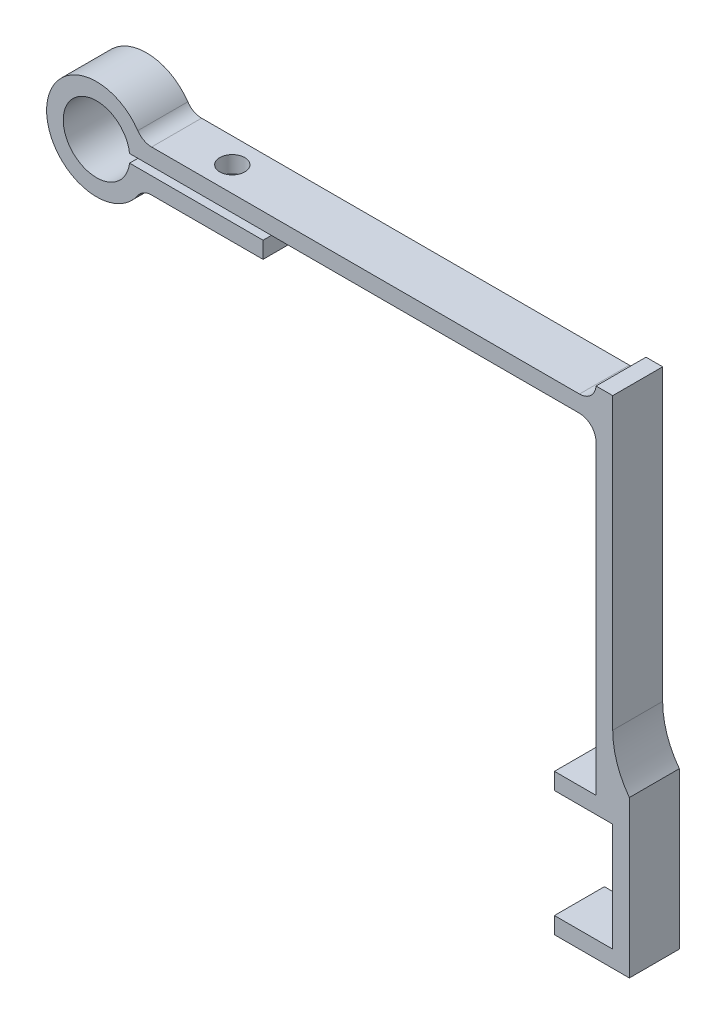
ISO-10303-21;
HEADER;
FILE_DESCRIPTION(('STEP AP214'),'2;1');
FILE_NAME('part.step','',(''),(''),'','','');
FILE_SCHEMA(('AUTOMOTIVE_DESIGN { 1 0 10303 214 1 1 1 1 }'));
ENDSEC;
DATA;
#1=APPLICATION_CONTEXT('core data for automotive mechanical design processes');
#2=APPLICATION_PROTOCOL_DEFINITION('international standard','automotive_design',2000,#1);
#3=PRODUCT_CONTEXT('',#1,'mechanical');
#4=PRODUCT('Part','Part','',(#3));
#5=PRODUCT_RELATED_PRODUCT_CATEGORY('part','',(#4));
#6=PRODUCT_DEFINITION_FORMATION('','',#4);
#7=PRODUCT_DEFINITION_CONTEXT('part definition',#1,'design');
#8=PRODUCT_DEFINITION('design','',#6,#7);
#9=PRODUCT_DEFINITION_SHAPE('','',#8);
#10=(LENGTH_UNIT() NAMED_UNIT(*) SI_UNIT(.MILLI.,.METRE.));
#11=(NAMED_UNIT(*) PLANE_ANGLE_UNIT() SI_UNIT($,.RADIAN.));
#12=(NAMED_UNIT(*) SI_UNIT($,.STERADIAN.) SOLID_ANGLE_UNIT());
#13=UNCERTAINTY_MEASURE_WITH_UNIT(LENGTH_MEASURE(1.E-05),#10,'distance_accuracy_value','');
#14=(GEOMETRIC_REPRESENTATION_CONTEXT(3) GLOBAL_UNCERTAINTY_ASSIGNED_CONTEXT((#13)) GLOBAL_UNIT_ASSIGNED_CONTEXT((#10,
#11,#12)) REPRESENTATION_CONTEXT('',''));
#15=CARTESIAN_POINT('',(0.,0.,0.));
#16=DIRECTION('',(0.,0.,1.));
#17=DIRECTION('',(1.,0.,0.));
#18=AXIS2_PLACEMENT_3D('',#15,#16,#17);
#19=CARTESIAN_POINT('',(62.,0.,0.));
#20=DIRECTION('',(1.,0.,0.));
#21=DIRECTION('',(0.,0.,-1.));
#22=AXIS2_PLACEMENT_3D('',#19,#20,#21);
#23=PLANE('',#22);
#24=DIRECTION('',(0.,0.,-1.));
#25=VECTOR('',#24,1.);
#26=CARTESIAN_POINT('',(62.,-53.25,0.));
#27=LINE('',#26,#25);
#28=CARTESIAN_POINT('',(62.,-53.25,6.));
#29=VERTEX_POINT('',#28);
#30=CARTESIAN_POINT('',(62.,-53.25,0.));
#31=VERTEX_POINT('',#30);
#32=EDGE_CURVE('E195',#29,#31,#27,.T.);
#33=ORIENTED_EDGE('',*,*,#32,.F.);
#34=DIRECTION('',(0.,-1.,0.));
#35=VECTOR('',#34,1.);
#36=CARTESIAN_POINT('',(62.,-36.4757426029915,6.));
#37=LINE('',#36,#35);
#38=CARTESIAN_POINT('',(62.,-40.25,6.));
#39=VERTEX_POINT('',#38);
#40=EDGE_CURVE('E206',#39,#29,#37,.T.);
#41=ORIENTED_EDGE('',*,*,#40,.F.);
#42=DIRECTION('',(0.,0.,-1.));
#43=VECTOR('',#42,1.);
#44=CARTESIAN_POINT('',(62.,-40.25,6.));
#45=LINE('',#44,#43);
#46=CARTESIAN_POINT('',(62.,-40.25,0.));
#47=VERTEX_POINT('',#46);
#48=EDGE_CURVE('E302',#39,#47,#45,.T.);
#49=ORIENTED_EDGE('',*,*,#48,.T.);
#50=DIRECTION('',(0.,1.,0.));
#51=VECTOR('',#50,1.);
#52=CARTESIAN_POINT('',(62.,-36.4757426029915,0.));
#53=LINE('',#52,#51);
#54=EDGE_CURVE('E207',#31,#47,#53,.T.);
#55=ORIENTED_EDGE('',*,*,#54,.F.);
#56=EDGE_LOOP('',(#33,#41,#49,#55));
#57=FACE_BOUND('',#56,.T.);
#58=ADVANCED_FACE('F36',(#57),#23,.F.);
#59=CARTESIAN_POINT('',(60.,0.5,6.));
#60=DIRECTION('',(1.,0.,0.));
#61=DIRECTION('',(0.,1.,0.));
#62=AXIS2_PLACEMENT_3D('',#59,#60,#61);
#63=PLANE('',#62);
#64=DIRECTION('',(0.,0.,-1.));
#65=VECTOR('',#64,1.);
#66=CARTESIAN_POINT('',(60.,-38.25,0.));
#67=LINE('',#66,#65);
#68=CARTESIAN_POINT('',(60.,-38.25,6.));
#69=VERTEX_POINT('',#68);
#70=CARTESIAN_POINT('',(60.,-38.25,0.));
#71=VERTEX_POINT('',#70);
#72=EDGE_CURVE('E51',#69,#71,#67,.T.);
#73=ORIENTED_EDGE('',*,*,#72,.F.);
#74=DIRECTION('',(0.,-1.,0.));
#75=VECTOR('',#74,1.);
#76=CARTESIAN_POINT('',(60.,0.5,6.));
#77=LINE('',#76,#75);
#78=CARTESIAN_POINT('',(60.,-1.5,6.));
#79=VERTEX_POINT('',#78);
#80=EDGE_CURVE('E252',#79,#69,#77,.T.);
#81=ORIENTED_EDGE('',*,*,#80,.F.);
#82=DIRECTION('',(0.,0.,-1.));
#83=VECTOR('',#82,1.);
#84=CARTESIAN_POINT('',(60.,-1.5,0.));
#85=LINE('',#84,#83);
#86=CARTESIAN_POINT('',(60.,-1.5,0.));
#87=VERTEX_POINT('',#86);
#88=EDGE_CURVE('E326',#79,#87,#85,.T.);
#89=ORIENTED_EDGE('',*,*,#88,.T.);
#90=DIRECTION('',(0.,-1.,0.));
#91=VECTOR('',#90,1.);
#92=CARTESIAN_POINT('',(60.,0.5,0.));
#93=LINE('',#92,#91);
#94=EDGE_CURVE('E56',#87,#71,#93,.T.);
#95=ORIENTED_EDGE('',*,*,#94,.T.);
#96=EDGE_LOOP('',(#73,#81,#89,#95));
#97=FACE_BOUND('',#96,.T.);
#98=ADVANCED_FACE('F416',(#97),#63,.F.);
#99=CARTESIAN_POINT('',(62.,-40.25,6.));
#100=DIRECTION('',(-1.,0.,0.));
#101=DIRECTION('',(0.,0.,1.));
#102=AXIS2_PLACEMENT_3D('',#99,#100,#101);
#103=PLANE('',#102);
#104=DIRECTION('',(0.,1.,0.));
#105=VECTOR('',#104,1.);
#106=CARTESIAN_POINT('',(62.,-40.25,6.));
#107=LINE('',#106,#105);
#108=CARTESIAN_POINT('',(62.,-30.4757426029915,6.));
#109=VERTEX_POINT('',#108);
#110=CARTESIAN_POINT('',(62.,4.33119529565432,6.));
#111=VERTEX_POINT('',#110);
#112=EDGE_CURVE('E255',#109,#111,#107,.T.);
#113=ORIENTED_EDGE('',*,*,#112,.F.);
#114=DIRECTION('',(0.,0.,1.));
#115=VECTOR('',#114,1.);
#116=CARTESIAN_POINT('',(62.,-30.4757426029915,6.));
#117=LINE('',#116,#115);
#118=CARTESIAN_POINT('',(62.,-30.4757426029915,0.));
#119=VERTEX_POINT('',#118);
#120=EDGE_CURVE('E346',#109,#119,#117,.F.);
#121=ORIENTED_EDGE('',*,*,#120,.T.);
#122=DIRECTION('',(0.,1.,0.));
#123=VECTOR('',#122,1.);
#124=CARTESIAN_POINT('',(62.,-40.25,0.));
#125=LINE('',#124,#123);
#126=CARTESIAN_POINT('',(62.,4.33119529565432,0.));
#127=VERTEX_POINT('',#126);
#128=EDGE_CURVE('E282',#119,#127,#125,.T.);
#129=ORIENTED_EDGE('',*,*,#128,.T.);
#130=DIRECTION('',(0.,0.,-1.));
#131=VECTOR('',#130,1.);
#132=CARTESIAN_POINT('',(62.,4.33119529565432,6.));
#133=LINE('',#132,#131);
#134=EDGE_CURVE('E299',#111,#127,#133,.T.);
#135=ORIENTED_EDGE('',*,*,#134,.F.);
#136=EDGE_LOOP('',(#113,#121,#129,#135));
#137=FACE_BOUND('',#136,.T.);
#138=ADVANCED_FACE('F357',(#137),#103,.F.);
#139=CARTESIAN_POINT('',(20.,-2.5,6.));
#140=DIRECTION('',(-1.,0.,0.));
#141=DIRECTION('',(0.,0.,1.));
#142=AXIS2_PLACEMENT_3D('',#139,#140,#141);
#143=PLANE('',#142);
#144=DIRECTION('',(0.,1.,0.));
#145=VECTOR('',#144,1.);
#146=CARTESIAN_POINT('',(20.,-2.5,0.));
#147=LINE('',#146,#145);
#148=CARTESIAN_POINT('',(20.,-2.5,0.));
#149=VERTEX_POINT('',#148);
#150=CARTESIAN_POINT('',(20.,-0.5,0.));
#151=VERTEX_POINT('',#150);
#152=EDGE_CURVE('E241',#149,#151,#147,.T.);
#153=ORIENTED_EDGE('',*,*,#152,.T.);
#154=DIRECTION('',(0.,0.,-1.));
#155=VECTOR('',#154,1.);
#156=CARTESIAN_POINT('',(20.,-0.5,6.));
#157=LINE('',#156,#155);
#158=CARTESIAN_POINT('',(20.,-0.5,6.));
#159=VERTEX_POINT('',#158);
#160=EDGE_CURVE('E310',#159,#151,#157,.T.);
#161=ORIENTED_EDGE('',*,*,#160,.F.);
#162=DIRECTION('',(0.,1.,0.));
#163=VECTOR('',#162,1.);
#164=CARTESIAN_POINT('',(20.,-2.5,6.));
#165=LINE('',#164,#163);
#166=CARTESIAN_POINT('',(20.,-2.5,6.));
#167=VERTEX_POINT('',#166);
#168=EDGE_CURVE('E242',#167,#159,#165,.T.);
#169=ORIENTED_EDGE('',*,*,#168,.F.);
#170=DIRECTION('',(0.,0.,-1.));
#171=VECTOR('',#170,1.);
#172=CARTESIAN_POINT('',(20.,-2.5,6.));
#173=LINE('',#172,#171);
#174=EDGE_CURVE('E267',#167,#149,#173,.T.);
#175=ORIENTED_EDGE('',*,*,#174,.T.);
#176=EDGE_LOOP('',(#153,#161,#169,#175));
#177=FACE_BOUND('',#176,.T.);
#178=ADVANCED_FACE('F435',(#177),#143,.F.);
#179=CARTESIAN_POINT('',(4.9749371855331,-0.5,6.));
#180=DIRECTION('',(0.,-1.,0.));
#181=DIRECTION('',(0.,0.,-1.));
#182=AXIS2_PLACEMENT_3D('',#179,#180,#181);
#183=PLANE('',#182);
#184=CARTESIAN_POINT('',(13.3071891388307,-0.5,3.));
#185=DIRECTION('',(0.,-1.,0.));
#186=DIRECTION('',(0.,0.,-1.));
#187=AXIS2_PLACEMENT_3D('',#184,#185,#186);
#188=CIRCLE('',#187,1.5);
#189=CARTESIAN_POINT('',(13.3071891388307,-0.5,1.5));
#190=VERTEX_POINT('',#189);
#191=EDGE_CURVE('E238',#190,#190,#188,.T.);
#192=ORIENTED_EDGE('',*,*,#191,.T.);
#193=EDGE_LOOP('',(#192));
#194=FACE_BOUND('',#193,.T.);
#195=DIRECTION('',(-1.,0.,0.));
#196=VECTOR('',#195,1.);
#197=CARTESIAN_POINT('',(4.9749371855331,-0.5,0.));
#198=LINE('',#197,#196);
#199=CARTESIAN_POINT('',(3.96862696659689,-0.500000000000001,0.));
#200=VERTEX_POINT('',#199);
#201=EDGE_CURVE('E270',#151,#200,#198,.T.);
#202=ORIENTED_EDGE('',*,*,#201,.T.);
#203=DIRECTION('',(0.,0.,-1.));
#204=VECTOR('',#203,1.);
#205=CARTESIAN_POINT('',(3.96862696659689,-0.500000000000001,6.));
#206=LINE('',#205,#204);
#207=CARTESIAN_POINT('',(3.96862696659689,-0.500000000000001,6.));
#208=VERTEX_POINT('',#207);
#209=EDGE_CURVE('E307',#208,#200,#206,.T.);
#210=ORIENTED_EDGE('',*,*,#209,.F.);
#211=DIRECTION('',(-1.,0.,0.));
#212=VECTOR('',#211,1.);
#213=CARTESIAN_POINT('',(4.9749371855331,-0.5,6.));
#214=LINE('',#213,#212);
#215=EDGE_CURVE('E244',#159,#208,#214,.T.);
#216=ORIENTED_EDGE('',*,*,#215,.F.);
#217=ORIENTED_EDGE('',*,*,#160,.T.);
#218=EDGE_LOOP('',(#202,#210,#216,#217));
#219=FACE_BOUND('',#218,.T.);
#220=ADVANCED_FACE('F432',(#194,#219),#183,.F.);
#221=CARTESIAN_POINT('',(0.,0.,6.));
#222=DIRECTION('',(0.,0.,-1.));
#223=DIRECTION('',(-1.,0.,0.));
#224=AXIS2_PLACEMENT_3D('',#221,#222,#223);
#225=CYLINDRICAL_SURFACE('',#224,4.);
#226=CARTESIAN_POINT('',(0.,0.,0.));
#227=DIRECTION('',(0.,0.,-1.));
#228=DIRECTION('',(1.,0.,0.));
#229=AXIS2_PLACEMENT_3D('',#226,#227,#228);
#230=CIRCLE('',#229,4.);
#231=CARTESIAN_POINT('',(3.96862696659689,0.5,0.));
#232=VERTEX_POINT('',#231);
#233=EDGE_CURVE('E272',#200,#232,#230,.T.);
#234=ORIENTED_EDGE('',*,*,#233,.T.);
#235=DIRECTION('',(0.,0.,-1.));
#236=VECTOR('',#235,1.);
#237=CARTESIAN_POINT('',(3.96862696659689,0.5,6.));
#238=LINE('',#237,#236);
#239=CARTESIAN_POINT('',(3.96862696659689,0.5,6.));
#240=VERTEX_POINT('',#239);
#241=EDGE_CURVE('E304',#240,#232,#238,.T.);
#242=ORIENTED_EDGE('',*,*,#241,.F.);
#243=CARTESIAN_POINT('',(0.,0.,6.));
#244=DIRECTION('',(0.,0.,-1.));
#245=DIRECTION('',(1.,0.,0.));
#246=AXIS2_PLACEMENT_3D('',#243,#244,#245);
#247=CIRCLE('',#246,4.);
#248=EDGE_CURVE('E247',#208,#240,#247,.T.);
#249=ORIENTED_EDGE('',*,*,#248,.F.);
#250=ORIENTED_EDGE('',*,*,#209,.T.);
#251=EDGE_LOOP('',(#234,#242,#249,#250));
#252=FACE_BOUND('',#251,.T.);
#253=ADVANCED_FACE('F427',(#252),#225,.F.);
#254=CARTESIAN_POINT('',(9.52711988649814,0.5,6.));
#255=DIRECTION('',(0.,1.,0.));
#256=DIRECTION('',(0.,0.,1.));
#257=AXIS2_PLACEMENT_3D('',#254,#255,#256);
#258=PLANE('',#257);
#259=CARTESIAN_POINT('',(13.3071891388307,0.5,3.));
#260=DIRECTION('',(0.,1.,0.));
#261=DIRECTION('',(0.,0.,1.));
#262=AXIS2_PLACEMENT_3D('',#259,#260,#261);
#263=CIRCLE('',#262,1.5);
#264=CARTESIAN_POINT('',(13.3071891388307,0.5,4.5));
#265=VERTEX_POINT('',#264);
#266=EDGE_CURVE('E235',#265,#265,#263,.T.);
#267=ORIENTED_EDGE('',*,*,#266,.T.);
#268=EDGE_LOOP('',(#267));
#269=FACE_BOUND('',#268,.T.);
#270=DIRECTION('',(1.,0.,0.));
#271=VECTOR('',#270,1.);
#272=CARTESIAN_POINT('',(9.52711988649814,0.5,0.));
#273=LINE('',#272,#271);
#274=CARTESIAN_POINT('',(58.,0.5,0.));
#275=VERTEX_POINT('',#274);
#276=EDGE_CURVE('E275',#232,#275,#273,.T.);
#277=ORIENTED_EDGE('',*,*,#276,.T.);
#278=DIRECTION('',(0.,0.,-1.));
#279=VECTOR('',#278,1.);
#280=CARTESIAN_POINT('',(58.,0.5,6.));
#281=LINE('',#280,#279);
#282=CARTESIAN_POINT('',(58.,0.5,6.));
#283=VERTEX_POINT('',#282);
#284=EDGE_CURVE('E328',#275,#283,#281,.F.);
#285=ORIENTED_EDGE('',*,*,#284,.T.);
#286=DIRECTION('',(1.,0.,0.));
#287=VECTOR('',#286,1.);
#288=CARTESIAN_POINT('',(4.9749371855331,0.5,6.));
#289=LINE('',#288,#287);
#290=EDGE_CURVE('E249',#240,#283,#289,.T.);
#291=ORIENTED_EDGE('',*,*,#290,.F.);
#292=ORIENTED_EDGE('',*,*,#241,.T.);
#293=EDGE_LOOP('',(#277,#285,#291,#292));
#294=FACE_BOUND('',#293,.T.);
#295=ADVANCED_FACE('F422',(#269,#294),#258,.F.);
#296=CARTESIAN_POINT('',(60.,-40.25,6.));
#297=DIRECTION('',(0.,1.,0.));
#298=DIRECTION('',(0.,0.,1.));
#299=AXIS2_PLACEMENT_3D('',#296,#297,#298);
#300=PLANE('',#299);
#301=DIRECTION('',(1.,0.,0.));
#302=VECTOR('',#301,1.);
#303=CARTESIAN_POINT('',(60.,-40.25,0.));
#304=LINE('',#303,#302);
#305=CARTESIAN_POINT('',(55.,-40.25,0.));
#306=VERTEX_POINT('',#305);
#307=EDGE_CURVE('E279',#306,#47,#304,.T.);
#308=ORIENTED_EDGE('',*,*,#307,.T.);
#309=ORIENTED_EDGE('',*,*,#48,.F.);
#310=DIRECTION('',(1.,0.,0.));
#311=VECTOR('',#310,1.);
#312=CARTESIAN_POINT('',(60.,-40.25,6.));
#313=LINE('',#312,#311);
#314=CARTESIAN_POINT('',(55.,-40.25,6.));
#315=VERTEX_POINT('',#314);
#316=EDGE_CURVE('E212',#315,#39,#313,.T.);
#317=ORIENTED_EDGE('',*,*,#316,.F.);
#318=DIRECTION('',(0.,0.,1.));
#319=VECTOR('',#318,1.);
#320=CARTESIAN_POINT('',(55.,-40.25,0.));
#321=LINE('',#320,#319);
#322=EDGE_CURVE('E384',#306,#315,#321,.T.);
#323=ORIENTED_EDGE('',*,*,#322,.F.);
#324=EDGE_LOOP('',(#308,#309,#317,#323));
#325=FACE_BOUND('',#324,.T.);
#326=ADVANCED_FACE('F406',(#325),#300,.F.);
#327=CARTESIAN_POINT('',(62.,4.33119529565432,6.));
#328=DIRECTION('',(0.,-1.,0.));
#329=DIRECTION('',(0.,0.,-1.));
#330=AXIS2_PLACEMENT_3D('',#327,#328,#329);
#331=PLANE('',#330);
#332=DIRECTION('',(-1.,0.,0.));
#333=VECTOR('',#332,1.);
#334=CARTESIAN_POINT('',(62.,4.33119529565432,0.));
#335=LINE('',#334,#333);
#336=CARTESIAN_POINT('',(60.,4.33119529565432,0.));
#337=VERTEX_POINT('',#336);
#338=EDGE_CURVE('E284',#127,#337,#335,.T.);
#339=ORIENTED_EDGE('',*,*,#338,.T.);
#340=DIRECTION('',(0.,0.,-1.));
#341=VECTOR('',#340,1.);
#342=CARTESIAN_POINT('',(60.,4.33119529565432,6.));
#343=LINE('',#342,#341);
#344=CARTESIAN_POINT('',(60.,4.33119529565432,6.));
#345=VERTEX_POINT('',#344);
#346=EDGE_CURVE('E296',#345,#337,#343,.T.);
#347=ORIENTED_EDGE('',*,*,#346,.F.);
#348=DIRECTION('',(-1.,0.,0.));
#349=VECTOR('',#348,1.);
#350=CARTESIAN_POINT('',(62.,4.33119529565432,6.));
#351=LINE('',#350,#349);
#352=EDGE_CURVE('E257',#111,#345,#351,.T.);
#353=ORIENTED_EDGE('',*,*,#352,.F.);
#354=ORIENTED_EDGE('',*,*,#134,.T.);
#355=EDGE_LOOP('',(#339,#347,#353,#354));
#356=FACE_BOUND('',#355,.T.);
#357=ADVANCED_FACE('F464',(#356),#331,.F.);
#358=CARTESIAN_POINT('',(60.,2.5,6.));
#359=DIRECTION('',(0.,-1.,0.));
#360=DIRECTION('',(1.,0.,0.));
#361=AXIS2_PLACEMENT_3D('',#358,#359,#360);
#362=PLANE('',#361);
#363=CARTESIAN_POINT('',(13.3071891388307,2.5,3.));
#364=DIRECTION('',(0.,-1.,0.));
#365=DIRECTION('',(1.,0.,0.));
#366=AXIS2_PLACEMENT_3D('',#363,#364,#365);
#367=CIRCLE('',#366,1.5);
#368=CARTESIAN_POINT('',(14.8071891388307,2.5,3.));
#369=VERTEX_POINT('',#368);
#370=EDGE_CURVE('E232',#369,#369,#367,.T.);
#371=ORIENTED_EDGE('',*,*,#370,.T.);
#372=EDGE_LOOP('',(#371));
#373=FACE_BOUND('',#372,.T.);
#374=DIRECTION('',(-1.,0.,0.));
#375=VECTOR('',#374,1.);
#376=CARTESIAN_POINT('',(60.,2.5,0.));
#377=LINE('',#376,#375);
#378=CARTESIAN_POINT('',(58.0071364894226,2.5,0.));
#379=VERTEX_POINT('',#378);
#380=CARTESIAN_POINT('',(6.61437827766148,2.49999999999999,0.));
#381=VERTEX_POINT('',#380);
#382=EDGE_CURVE('E287',#379,#381,#377,.T.);
#383=ORIENTED_EDGE('',*,*,#382,.T.);
#384=DIRECTION('',(0.,0.,1.));
#385=VECTOR('',#384,1.);
#386=CARTESIAN_POINT('',(6.61437827766148,2.49999999999999,6.));
#387=LINE('',#386,#385);
#388=CARTESIAN_POINT('',(6.61437827766148,2.49999999999999,6.));
#389=VERTEX_POINT('',#388);
#390=EDGE_CURVE('E321',#381,#389,#387,.T.);
#391=ORIENTED_EDGE('',*,*,#390,.T.);
#392=DIRECTION('',(-1.,0.,0.));
#393=VECTOR('',#392,1.);
#394=CARTESIAN_POINT('',(60.,2.5,6.));
#395=LINE('',#394,#393);
#396=CARTESIAN_POINT('',(58.0071364894226,2.5,6.));
#397=VERTEX_POINT('',#396);
#398=EDGE_CURVE('E259',#397,#389,#395,.T.);
#399=ORIENTED_EDGE('',*,*,#398,.F.);
#400=DIRECTION('',(0.,0.,-1.));
#401=VECTOR('',#400,1.);
#402=CARTESIAN_POINT('',(58.0071364894226,2.5,6.));
#403=LINE('',#402,#401);
#404=EDGE_CURVE('E318',#397,#379,#403,.T.);
#405=ORIENTED_EDGE('',*,*,#404,.T.);
#406=EDGE_LOOP('',(#383,#391,#399,#405));
#407=FACE_BOUND('',#406,.T.);
#408=ADVANCED_FACE('F456',(#373,#407),#362,.F.);
#409=CARTESIAN_POINT('',(0.,0.,6.));
#410=DIRECTION('',(0.,0.,-1.));
#411=DIRECTION('',(-1.,0.,0.));
#412=AXIS2_PLACEMENT_3D('',#409,#410,#411);
#413=CYLINDRICAL_SURFACE('',#412,6.);
#414=CARTESIAN_POINT('',(0.,0.,6.));
#415=DIRECTION('',(0.,0.,1.));
#416=DIRECTION('',(1.,0.,0.));
#417=AXIS2_PLACEMENT_3D('',#414,#415,#416);
#418=CIRCLE('',#417,6.);
#419=CARTESIAN_POINT('',(4.96078370824611,3.375,6.));
#420=VERTEX_POINT('',#419);
#421=CARTESIAN_POINT('',(4.96078370824611,-3.375,6.));
#422=VERTEX_POINT('',#421);
#423=EDGE_CURVE('E262',#420,#422,#418,.T.);
#424=ORIENTED_EDGE('',*,*,#423,.F.);
#425=DIRECTION('',(0.,0.,-1.));
#426=VECTOR('',#425,1.);
#427=CARTESIAN_POINT('',(4.96078370824611,3.375,6.));
#428=LINE('',#427,#426);
#429=CARTESIAN_POINT('',(4.96078370824611,3.375,0.));
#430=VERTEX_POINT('',#429);
#431=EDGE_CURVE('E315',#420,#430,#428,.T.);
#432=ORIENTED_EDGE('',*,*,#431,.T.);
#433=CARTESIAN_POINT('',(0.,0.,0.));
#434=DIRECTION('',(0.,0.,1.));
#435=DIRECTION('',(1.,0.,0.));
#436=AXIS2_PLACEMENT_3D('',#433,#434,#435);
#437=CIRCLE('',#436,6.);
#438=CARTESIAN_POINT('',(4.96078370824611,-3.375,0.));
#439=VERTEX_POINT('',#438);
#440=EDGE_CURVE('E290',#430,#439,#437,.T.);
#441=ORIENTED_EDGE('',*,*,#440,.T.);
#442=DIRECTION('',(0.,0.,-1.));
#443=VECTOR('',#442,1.);
#444=CARTESIAN_POINT('',(4.96078370824611,-3.375,6.));
#445=LINE('',#444,#443);
#446=EDGE_CURVE('E313',#439,#422,#445,.F.);
#447=ORIENTED_EDGE('',*,*,#446,.T.);
#448=EDGE_LOOP('',(#424,#432,#441,#447));
#449=FACE_BOUND('',#448,.T.);
#450=ADVANCED_FACE('F446',(#449),#413,.T.);
#451=CARTESIAN_POINT('',(20.,-2.5,6.));
#452=DIRECTION('',(0.,1.,0.));
#453=DIRECTION('',(-1.,0.,0.));
#454=AXIS2_PLACEMENT_3D('',#451,#452,#453);
#455=PLANE('',#454);
#456=CARTESIAN_POINT('',(13.3071891388307,-2.5,3.));
#457=DIRECTION('',(0.,-1.,0.));
#458=DIRECTION('',(1.,0.,0.));
#459=AXIS2_PLACEMENT_3D('',#456,#457,#458);
#460=CIRCLE('',#459,1.5);
#461=CARTESIAN_POINT('',(14.8071891388307,-2.5,3.));
#462=VERTEX_POINT('',#461);
#463=EDGE_CURVE('E229',#462,#462,#460,.T.);
#464=ORIENTED_EDGE('',*,*,#463,.F.);
#465=EDGE_LOOP('',(#464));
#466=FACE_BOUND('',#465,.T.);
#467=DIRECTION('',(1.,0.,0.));
#468=VECTOR('',#467,1.);
#469=CARTESIAN_POINT('',(20.,-2.5,6.));
#470=LINE('',#469,#468);
#471=CARTESIAN_POINT('',(6.61437827766148,-2.5,6.));
#472=VERTEX_POINT('',#471);
#473=EDGE_CURVE('E265',#472,#167,#470,.T.);
#474=ORIENTED_EDGE('',*,*,#473,.F.);
#475=DIRECTION('',(0.,0.,1.));
#476=VECTOR('',#475,1.);
#477=CARTESIAN_POINT('',(6.61437827766148,-2.5,0.));
#478=LINE('',#477,#476);
#479=CARTESIAN_POINT('',(6.61437827766148,-2.5,0.));
#480=VERTEX_POINT('',#479);
#481=EDGE_CURVE('E323',#472,#480,#478,.F.);
#482=ORIENTED_EDGE('',*,*,#481,.T.);
#483=DIRECTION('',(1.,0.,0.));
#484=VECTOR('',#483,1.);
#485=CARTESIAN_POINT('',(20.,-2.5,0.));
#486=LINE('',#485,#484);
#487=EDGE_CURVE('E245',#480,#149,#486,.T.);
#488=ORIENTED_EDGE('',*,*,#487,.T.);
#489=ORIENTED_EDGE('',*,*,#174,.F.);
#490=EDGE_LOOP('',(#474,#482,#488,#489));
#491=FACE_BOUND('',#490,.T.);
#492=ADVANCED_FACE('F439',(#466,#491),#455,.F.);
#493=CARTESIAN_POINT('',(0.,0.,6.));
#494=DIRECTION('',(0.,0.,1.));
#495=DIRECTION('',(1.,0.,0.));
#496=AXIS2_PLACEMENT_3D('',#493,#494,#495);
#497=PLANE('',#496);
#498=ORIENTED_EDGE('',*,*,#168,.T.);
#499=ORIENTED_EDGE('',*,*,#215,.T.);
#500=ORIENTED_EDGE('',*,*,#248,.T.);
#501=ORIENTED_EDGE('',*,*,#290,.T.);
#502=CARTESIAN_POINT('',(58.,-1.5,6.));
#503=DIRECTION('',(0.,0.,1.));
#504=DIRECTION('',(1.,0.,0.));
#505=AXIS2_PLACEMENT_3D('',#502,#503,#504);
#506=CIRCLE('',#505,2.);
#507=EDGE_CURVE('E344',#283,#79,#506,.F.);
#508=ORIENTED_EDGE('',*,*,#507,.T.);
#509=ORIENTED_EDGE('',*,*,#80,.T.);
#510=DIRECTION('',(1.,0.,0.));
#511=VECTOR('',#510,1.);
#512=CARTESIAN_POINT('',(55.,-38.25,6.));
#513=LINE('',#512,#511);
#514=CARTESIAN_POINT('',(55.,-38.25,6.));
#515=VERTEX_POINT('',#514);
#516=EDGE_CURVE('E214',#515,#69,#513,.T.);
#517=ORIENTED_EDGE('',*,*,#516,.F.);
#518=DIRECTION('',(0.,1.,0.));
#519=VECTOR('',#518,1.);
#520=CARTESIAN_POINT('',(55.,-40.25,6.));
#521=LINE('',#520,#519);
#522=EDGE_CURVE('E382',#315,#515,#521,.T.);
#523=ORIENTED_EDGE('',*,*,#522,.F.);
#524=ORIENTED_EDGE('',*,*,#316,.T.);
#525=ORIENTED_EDGE('',*,*,#40,.T.);
#526=DIRECTION('',(1.,0.,0.));
#527=VECTOR('',#526,1.);
#528=CARTESIAN_POINT('',(48.6754446796633,-53.25,6.));
#529=LINE('',#528,#527);
#530=CARTESIAN_POINT('',(55.,-53.25,6.));
#531=VERTEX_POINT('',#530);
#532=EDGE_CURVE('E191',#531,#29,#529,.T.);
#533=ORIENTED_EDGE('',*,*,#532,.F.);
#534=DIRECTION('',(0.,-1.,0.));
#535=VECTOR('',#534,1.);
#536=CARTESIAN_POINT('',(55.,-55.25,6.));
#537=LINE('',#536,#535);
#538=CARTESIAN_POINT('',(55.,-55.25,6.));
#539=VERTEX_POINT('',#538);
#540=EDGE_CURVE('E389',#531,#539,#537,.T.);
#541=ORIENTED_EDGE('',*,*,#540,.T.);
#542=DIRECTION('',(-1.,0.,0.));
#543=VECTOR('',#542,1.);
#544=CARTESIAN_POINT('',(64.,-55.25,6.));
#545=LINE('',#544,#543);
#546=CARTESIAN_POINT('',(64.,-55.25,6.));
#547=VERTEX_POINT('',#546);
#548=EDGE_CURVE('E227',#547,#539,#545,.T.);
#549=ORIENTED_EDGE('',*,*,#548,.F.);
#550=DIRECTION('',(0.,-1.,0.));
#551=VECTOR('',#550,1.);
#552=CARTESIAN_POINT('',(64.,-36.4757426029915,6.));
#553=LINE('',#552,#551);
#554=CARTESIAN_POINT('',(64.,-36.4757426029915,6.));
#555=VERTEX_POINT('',#554);
#556=EDGE_CURVE('E216',#555,#547,#553,.T.);
#557=ORIENTED_EDGE('',*,*,#556,.F.);
#558=CARTESIAN_POINT('',(72.,-30.4757426029915,6.));
#559=DIRECTION('',(0.,0.,1.));
#560=DIRECTION('',(1.,0.,0.));
#561=AXIS2_PLACEMENT_3D('',#558,#559,#560);
#562=CIRCLE('',#561,10.);
#563=EDGE_CURVE('E44',#555,#109,#562,.F.);
#564=ORIENTED_EDGE('',*,*,#563,.T.);
#565=ORIENTED_EDGE('',*,*,#112,.T.);
#566=ORIENTED_EDGE('',*,*,#352,.T.);
#567=CARTESIAN_POINT('',(58.0071364894226,4.5,6.));
#568=DIRECTION('',(0.,0.,1.));
#569=DIRECTION('',(1.,0.,0.));
#570=AXIS2_PLACEMENT_3D('',#567,#568,#569);
#571=CIRCLE('',#570,2.);
#572=EDGE_CURVE('E340',#345,#397,#571,.F.);
#573=ORIENTED_EDGE('',*,*,#572,.T.);
#574=ORIENTED_EDGE('',*,*,#398,.T.);
#575=CARTESIAN_POINT('',(6.61437827766148,4.49999999999999,6.));
#576=DIRECTION('',(0.,0.,1.));
#577=DIRECTION('',(1.,0.,0.));
#578=AXIS2_PLACEMENT_3D('',#575,#576,#577);
#579=CIRCLE('',#578,2.);
#580=EDGE_CURVE('E332',#389,#420,#579,.F.);
#581=ORIENTED_EDGE('',*,*,#580,.T.);
#582=ORIENTED_EDGE('',*,*,#423,.T.);
#583=CARTESIAN_POINT('',(6.61437827766148,-4.5,6.));
#584=DIRECTION('',(0.,0.,1.));
#585=DIRECTION('',(1.,0.,0.));
#586=AXIS2_PLACEMENT_3D('',#583,#584,#585);
#587=CIRCLE('',#586,2.);
#588=EDGE_CURVE('E336',#422,#472,#587,.F.);
#589=ORIENTED_EDGE('',*,*,#588,.T.);
#590=ORIENTED_EDGE('',*,*,#473,.T.);
#591=EDGE_LOOP('',(#498,#499,#500,#501,#508,#509,#517,#523,#524,#525,#533,#541,#549,#557,#564,
#565,#566,#573,#574,#581,#582,#589,#590));
#592=FACE_BOUND('',#591,.T.);
#593=ADVANCED_FACE('F210',(#592),#497,.T.);
#594=CARTESIAN_POINT('',(0.,0.,0.));
#595=DIRECTION('',(0.,0.,1.));
#596=DIRECTION('',(1.,0.,0.));
#597=AXIS2_PLACEMENT_3D('',#594,#595,#596);
#598=PLANE('',#597);
#599=ORIENTED_EDGE('',*,*,#152,.F.);
#600=ORIENTED_EDGE('',*,*,#487,.F.);
#601=CARTESIAN_POINT('',(6.61437827766148,-4.5,0.));
#602=DIRECTION('',(0.,0.,1.));
#603=DIRECTION('',(1.,0.,0.));
#604=AXIS2_PLACEMENT_3D('',#601,#602,#603);
#605=CIRCLE('',#604,2.);
#606=EDGE_CURVE('E334',#480,#439,#605,.T.);
#607=ORIENTED_EDGE('',*,*,#606,.T.);
#608=ORIENTED_EDGE('',*,*,#440,.F.);
#609=CARTESIAN_POINT('',(6.61437827766148,4.49999999999999,0.));
#610=DIRECTION('',(0.,0.,1.));
#611=DIRECTION('',(1.,0.,0.));
#612=AXIS2_PLACEMENT_3D('',#609,#610,#611);
#613=CIRCLE('',#612,2.);
#614=EDGE_CURVE('E330',#430,#381,#613,.T.);
#615=ORIENTED_EDGE('',*,*,#614,.T.);
#616=ORIENTED_EDGE('',*,*,#382,.F.);
#617=CARTESIAN_POINT('',(58.0071364894226,4.5,0.));
#618=DIRECTION('',(0.,0.,1.));
#619=DIRECTION('',(1.,0.,0.));
#620=AXIS2_PLACEMENT_3D('',#617,#618,#619);
#621=CIRCLE('',#620,2.);
#622=EDGE_CURVE('E338',#379,#337,#621,.T.);
#623=ORIENTED_EDGE('',*,*,#622,.T.);
#624=ORIENTED_EDGE('',*,*,#338,.F.);
#625=ORIENTED_EDGE('',*,*,#128,.F.);
#626=CARTESIAN_POINT('',(72.,-30.4757426029915,0.));
#627=DIRECTION('',(0.,0.,1.));
#628=DIRECTION('',(1.,0.,0.));
#629=AXIS2_PLACEMENT_3D('',#626,#627,#628);
#630=CIRCLE('',#629,10.);
#631=CARTESIAN_POINT('',(64.,-36.4757426029915,0.));
#632=VERTEX_POINT('',#631);
#633=EDGE_CURVE('E11',#119,#632,#630,.T.);
#634=ORIENTED_EDGE('',*,*,#633,.T.);
#635=DIRECTION('',(0.,1.,0.));
#636=VECTOR('',#635,1.);
#637=CARTESIAN_POINT('',(64.,-36.4757426029915,0.));
#638=LINE('',#637,#636);
#639=CARTESIAN_POINT('',(64.,-55.25,0.));
#640=VERTEX_POINT('',#639);
#641=EDGE_CURVE('E366',#640,#632,#638,.T.);
#642=ORIENTED_EDGE('',*,*,#641,.F.);
#643=DIRECTION('',(-1.,0.,0.));
#644=VECTOR('',#643,1.);
#645=CARTESIAN_POINT('',(64.,-55.25,0.));
#646=LINE('',#645,#644);
#647=CARTESIAN_POINT('',(55.,-55.25,0.));
#648=VERTEX_POINT('',#647);
#649=EDGE_CURVE('E225',#640,#648,#646,.T.);
#650=ORIENTED_EDGE('',*,*,#649,.T.);
#651=DIRECTION('',(0.,1.,0.));
#652=VECTOR('',#651,1.);
#653=CARTESIAN_POINT('',(55.,-55.25,0.));
#654=LINE('',#653,#652);
#655=CARTESIAN_POINT('',(55.,-53.25,0.));
#656=VERTEX_POINT('',#655);
#657=EDGE_CURVE('E380',#648,#656,#654,.T.);
#658=ORIENTED_EDGE('',*,*,#657,.T.);
#659=DIRECTION('',(1.,0.,0.));
#660=VECTOR('',#659,1.);
#661=CARTESIAN_POINT('',(48.6754446796633,-53.25,0.));
#662=LINE('',#661,#660);
#663=EDGE_CURVE('E201',#656,#31,#662,.T.);
#664=ORIENTED_EDGE('',*,*,#663,.T.);
#665=ORIENTED_EDGE('',*,*,#54,.T.);
#666=ORIENTED_EDGE('',*,*,#307,.F.);
#667=DIRECTION('',(0.,-1.,0.));
#668=VECTOR('',#667,1.);
#669=CARTESIAN_POINT('',(55.,-40.25,0.));
#670=LINE('',#669,#668);
#671=CARTESIAN_POINT('',(55.,-38.25,0.));
#672=VERTEX_POINT('',#671);
#673=EDGE_CURVE('E379',#672,#306,#670,.T.);
#674=ORIENTED_EDGE('',*,*,#673,.F.);
#675=DIRECTION('',(1.,0.,0.));
#676=VECTOR('',#675,1.);
#677=CARTESIAN_POINT('',(55.,-38.25,0.));
#678=LINE('',#677,#676);
#679=EDGE_CURVE('E219',#672,#71,#678,.T.);
#680=ORIENTED_EDGE('',*,*,#679,.T.);
#681=ORIENTED_EDGE('',*,*,#94,.F.);
#682=CARTESIAN_POINT('',(58.,-1.5,0.));
#683=DIRECTION('',(0.,0.,1.));
#684=DIRECTION('',(1.,0.,0.));
#685=AXIS2_PLACEMENT_3D('',#682,#683,#684);
#686=CIRCLE('',#685,2.);
#687=EDGE_CURVE('E342',#87,#275,#686,.T.);
#688=ORIENTED_EDGE('',*,*,#687,.T.);
#689=ORIENTED_EDGE('',*,*,#276,.F.);
#690=ORIENTED_EDGE('',*,*,#233,.F.);
#691=ORIENTED_EDGE('',*,*,#201,.F.);
#692=EDGE_LOOP('',(#599,#600,#607,#608,#615,#616,#623,#624,#625,#634,#642,#650,#658,#664,#665,
#666,#674,#680,#681,#688,#689,#690,#691));
#693=FACE_BOUND('',#692,.T.);
#694=ADVANCED_FACE('F365',(#693),#598,.F.);
#695=CARTESIAN_POINT('',(6.61437827766148,4.49999999999999,6.));
#696=DIRECTION('',(0.,0.,-1.));
#697=DIRECTION('',(-1.,0.,0.));
#698=AXIS2_PLACEMENT_3D('',#695,#696,#697);
#699=CYLINDRICAL_SURFACE('',#698,2.);
#700=ORIENTED_EDGE('',*,*,#580,.F.);
#701=ORIENTED_EDGE('',*,*,#390,.F.);
#702=ORIENTED_EDGE('',*,*,#614,.F.);
#703=ORIENTED_EDGE('',*,*,#431,.F.);
#704=EDGE_LOOP('',(#700,#701,#702,#703));
#705=FACE_BOUND('',#704,.T.);
#706=ADVANCED_FACE('F452',(#705),#699,.F.);
#707=CARTESIAN_POINT('',(6.61437827766148,-4.5,6.));
#708=DIRECTION('',(0.,0.,-1.));
#709=DIRECTION('',(-1.,0.,0.));
#710=AXIS2_PLACEMENT_3D('',#707,#708,#709);
#711=CYLINDRICAL_SURFACE('',#710,2.);
#712=ORIENTED_EDGE('',*,*,#588,.F.);
#713=ORIENTED_EDGE('',*,*,#446,.F.);
#714=ORIENTED_EDGE('',*,*,#606,.F.);
#715=ORIENTED_EDGE('',*,*,#481,.F.);
#716=EDGE_LOOP('',(#712,#713,#714,#715));
#717=FACE_BOUND('',#716,.T.);
#718=ADVANCED_FACE('F449',(#717),#711,.F.);
#719=CARTESIAN_POINT('',(58.0071364894226,4.5,6.));
#720=DIRECTION('',(0.,0.,-1.));
#721=DIRECTION('',(-1.,0.,0.));
#722=AXIS2_PLACEMENT_3D('',#719,#720,#721);
#723=CYLINDRICAL_SURFACE('',#722,2.);
#724=ORIENTED_EDGE('',*,*,#572,.F.);
#725=ORIENTED_EDGE('',*,*,#346,.T.);
#726=ORIENTED_EDGE('',*,*,#622,.F.);
#727=ORIENTED_EDGE('',*,*,#404,.F.);
#728=EDGE_LOOP('',(#724,#725,#726,#727));
#729=FACE_BOUND('',#728,.T.);
#730=ADVANCED_FACE('F461',(#729),#723,.F.);
#731=CARTESIAN_POINT('',(58.,-1.5,6.));
#732=DIRECTION('',(0.,0.,1.));
#733=DIRECTION('',(1.,0.,0.));
#734=AXIS2_PLACEMENT_3D('',#731,#732,#733);
#735=CYLINDRICAL_SURFACE('',#734,2.);
#736=ORIENTED_EDGE('',*,*,#507,.F.);
#737=ORIENTED_EDGE('',*,*,#284,.F.);
#738=ORIENTED_EDGE('',*,*,#687,.F.);
#739=ORIENTED_EDGE('',*,*,#88,.F.);
#740=EDGE_LOOP('',(#736,#737,#738,#739));
#741=FACE_BOUND('',#740,.T.);
#742=ADVANCED_FACE('F418',(#741),#735,.F.);
#743=CARTESIAN_POINT('',(13.3071891388307,7.5,3.));
#744=DIRECTION('',(0.,-1.,0.));
#745=DIRECTION('',(1.,0.,0.));
#746=AXIS2_PLACEMENT_3D('',#743,#744,#745);
#747=CYLINDRICAL_SURFACE('',#746,1.5);
#748=ORIENTED_EDGE('',*,*,#463,.T.);
#749=EDGE_LOOP('',(#748));
#750=FACE_BOUND('',#749,.T.);
#751=ORIENTED_EDGE('',*,*,#191,.F.);
#752=EDGE_LOOP('',(#751));
#753=FACE_BOUND('',#752,.T.);
#754=ADVANCED_FACE('F487',(#750,#753),#747,.F.);
#755=ORIENTED_EDGE('',*,*,#370,.F.);
#756=EDGE_LOOP('',(#755));
#757=FACE_BOUND('',#756,.T.);
#758=ORIENTED_EDGE('',*,*,#266,.F.);
#759=EDGE_LOOP('',(#758));
#760=FACE_BOUND('',#759,.T.);
#761=ADVANCED_FACE('F486',(#757,#760),#747,.F.);
#762=CARTESIAN_POINT('',(64.,-55.25,6.));
#763=DIRECTION('',(0.,1.,0.));
#764=DIRECTION('',(0.,0.,1.));
#765=AXIS2_PLACEMENT_3D('',#762,#763,#764);
#766=PLANE('',#765);
#767=ORIENTED_EDGE('',*,*,#548,.T.);
#768=DIRECTION('',(0.,0.,-1.));
#769=VECTOR('',#768,1.);
#770=CARTESIAN_POINT('',(55.,-55.25,0.));
#771=LINE('',#770,#769);
#772=EDGE_CURVE('E394',#539,#648,#771,.T.);
#773=ORIENTED_EDGE('',*,*,#772,.T.);
#774=ORIENTED_EDGE('',*,*,#649,.F.);
#775=DIRECTION('',(0.,0.,-1.));
#776=VECTOR('',#775,1.);
#777=CARTESIAN_POINT('',(64.,-55.25,6.));
#778=LINE('',#777,#776);
#779=EDGE_CURVE('E370',#547,#640,#778,.T.);
#780=ORIENTED_EDGE('',*,*,#779,.F.);
#781=EDGE_LOOP('',(#767,#773,#774,#780));
#782=FACE_BOUND('',#781,.T.);
#783=ADVANCED_FACE('F402',(#782),#766,.F.);
#784=CARTESIAN_POINT('',(64.,0.,0.));
#785=DIRECTION('',(1.,0.,0.));
#786=DIRECTION('',(0.,0.,-1.));
#787=AXIS2_PLACEMENT_3D('',#784,#785,#786);
#788=PLANE('',#787);
#789=ORIENTED_EDGE('',*,*,#556,.T.);
#790=ORIENTED_EDGE('',*,*,#779,.T.);
#791=ORIENTED_EDGE('',*,*,#641,.T.);
#792=DIRECTION('',(0.,0.,1.));
#793=VECTOR('',#792,1.);
#794=CARTESIAN_POINT('',(64.,-36.4757426029915,6.));
#795=LINE('',#794,#793);
#796=EDGE_CURVE('E222',#632,#555,#795,.T.);
#797=ORIENTED_EDGE('',*,*,#796,.T.);
#798=EDGE_LOOP('',(#789,#790,#791,#797));
#799=FACE_BOUND('',#798,.T.);
#800=ADVANCED_FACE('F369',(#799),#788,.T.);
#801=CARTESIAN_POINT('',(72.,-30.4757426029915,6.));
#802=DIRECTION('',(0.,0.,1.));
#803=DIRECTION('',(1.,0.,0.));
#804=AXIS2_PLACEMENT_3D('',#801,#802,#803);
#805=CYLINDRICAL_SURFACE('',#804,10.);
#806=ORIENTED_EDGE('',*,*,#633,.F.);
#807=ORIENTED_EDGE('',*,*,#120,.F.);
#808=ORIENTED_EDGE('',*,*,#563,.F.);
#809=ORIENTED_EDGE('',*,*,#796,.F.);
#810=EDGE_LOOP('',(#806,#807,#808,#809));
#811=FACE_BOUND('',#810,.T.);
#812=ADVANCED_FACE('F38',(#811),#805,.F.);
#813=CARTESIAN_POINT('',(55.,-38.25,0.));
#814=DIRECTION('',(0.,-1.,0.));
#815=DIRECTION('',(1.,0.,0.));
#816=AXIS2_PLACEMENT_3D('',#813,#814,#815);
#817=PLANE('',#816);
#818=ORIENTED_EDGE('',*,*,#72,.T.);
#819=ORIENTED_EDGE('',*,*,#679,.F.);
#820=DIRECTION('',(0.,0.,-1.));
#821=VECTOR('',#820,1.);
#822=CARTESIAN_POINT('',(55.,-38.25,0.));
#823=LINE('',#822,#821);
#824=EDGE_CURVE('E377',#515,#672,#823,.T.);
#825=ORIENTED_EDGE('',*,*,#824,.F.);
#826=ORIENTED_EDGE('',*,*,#516,.T.);
#827=EDGE_LOOP('',(#818,#819,#825,#826));
#828=FACE_BOUND('',#827,.T.);
#829=ADVANCED_FACE('F412',(#828),#817,.F.);
#830=CARTESIAN_POINT('',(55.,0.,0.));
#831=DIRECTION('',(1.,0.,0.));
#832=DIRECTION('',(0.,0.,-1.));
#833=AXIS2_PLACEMENT_3D('',#830,#831,#832);
#834=PLANE('',#833);
#835=ORIENTED_EDGE('',*,*,#673,.T.);
#836=ORIENTED_EDGE('',*,*,#322,.T.);
#837=ORIENTED_EDGE('',*,*,#522,.T.);
#838=ORIENTED_EDGE('',*,*,#824,.T.);
#839=EDGE_LOOP('',(#835,#836,#837,#838));
#840=FACE_BOUND('',#839,.T.);
#841=ADVANCED_FACE('F408',(#840),#834,.F.);
#842=CARTESIAN_POINT('',(48.6754446796633,-53.25,0.));
#843=DIRECTION('',(0.,-1.,0.));
#844=DIRECTION('',(0.,0.,-1.));
#845=AXIS2_PLACEMENT_3D('',#842,#843,#844);
#846=PLANE('',#845);
#847=ORIENTED_EDGE('',*,*,#663,.F.);
#848=DIRECTION('',(0.,0.,1.));
#849=VECTOR('',#848,1.);
#850=CARTESIAN_POINT('',(55.,-53.25,0.));
#851=LINE('',#850,#849);
#852=EDGE_CURVE('E197',#656,#531,#851,.T.);
#853=ORIENTED_EDGE('',*,*,#852,.T.);
#854=ORIENTED_EDGE('',*,*,#532,.T.);
#855=ORIENTED_EDGE('',*,*,#32,.T.);
#856=EDGE_LOOP('',(#847,#853,#854,#855));
#857=FACE_BOUND('',#856,.T.);
#858=ADVANCED_FACE('F194',(#857),#846,.F.);
#859=CARTESIAN_POINT('',(55.,0.,0.));
#860=DIRECTION('',(1.,0.,0.));
#861=DIRECTION('',(0.,0.,-1.));
#862=AXIS2_PLACEMENT_3D('',#859,#860,#861);
#863=PLANE('',#862);
#864=ORIENTED_EDGE('',*,*,#772,.F.);
#865=ORIENTED_EDGE('',*,*,#540,.F.);
#866=ORIENTED_EDGE('',*,*,#852,.F.);
#867=ORIENTED_EDGE('',*,*,#657,.F.);
#868=EDGE_LOOP('',(#864,#865,#866,#867));
#869=FACE_BOUND('',#868,.T.);
#870=ADVANCED_FACE('F399',(#869),#863,.F.);
#871=CLOSED_SHELL('',(#58,#98,#138,#178,#220,#253,#295,#326,#357,#408,#450,#492,#593,#694,#706,
#718,#730,#742,#754,#761,#783,#800,#812,#829,#841,#858,#870));
#872=MANIFOLD_SOLID_BREP('B2',#871);
#873=ADVANCED_BREP_SHAPE_REPRESENTATION('',(#18,#872),#14);
#874=SHAPE_DEFINITION_REPRESENTATION(#9,#873);
ENDSEC;
END-ISO-10303-21;
